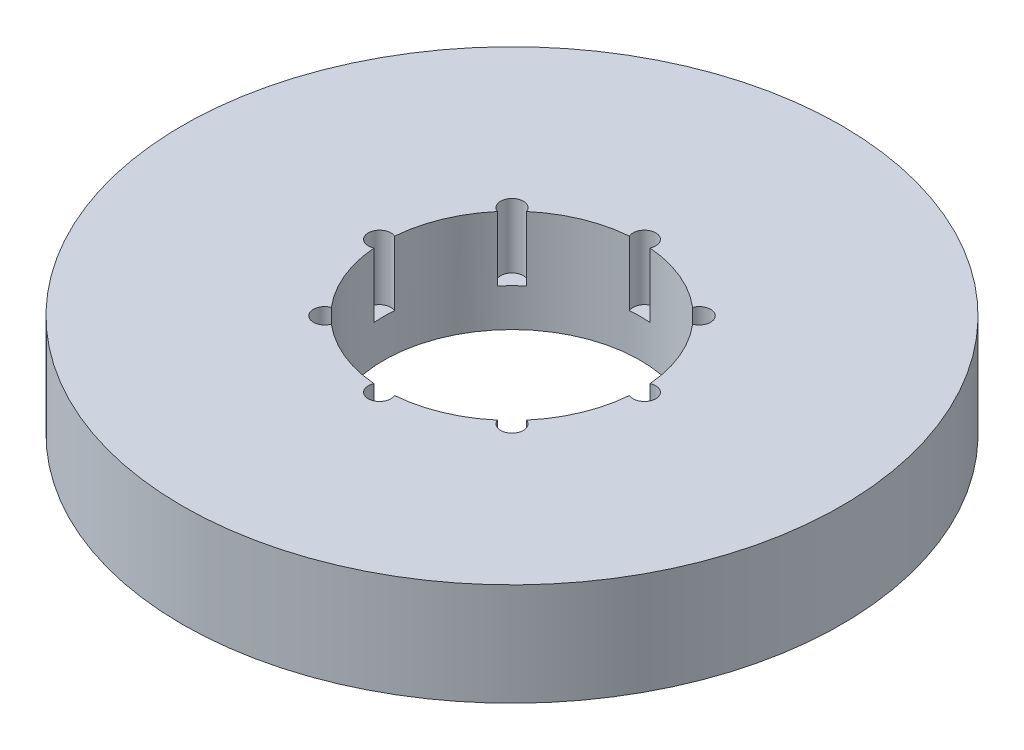
ISO-10303-21;
HEADER;
FILE_DESCRIPTION(('STEP AP214'),'2;1');
FILE_NAME('part.step','',(''),(''),'','','');
FILE_SCHEMA(('AUTOMOTIVE_DESIGN { 1 0 10303 214 1 1 1 1 }'));
ENDSEC;
DATA;
#1=APPLICATION_CONTEXT('core data for automotive mechanical design processes');
#2=APPLICATION_PROTOCOL_DEFINITION('international standard','automotive_design',2000,#1);
#3=PRODUCT_CONTEXT('',#1,'mechanical');
#4=PRODUCT('Part','Part','',(#3));
#5=PRODUCT_RELATED_PRODUCT_CATEGORY('part','',(#4));
#6=PRODUCT_DEFINITION_FORMATION('','',#4);
#7=PRODUCT_DEFINITION_CONTEXT('part definition',#1,'design');
#8=PRODUCT_DEFINITION('design','',#6,#7);
#9=PRODUCT_DEFINITION_SHAPE('','',#8);
#10=(LENGTH_UNIT() NAMED_UNIT(*) SI_UNIT(.MILLI.,.METRE.));
#11=(NAMED_UNIT(*) PLANE_ANGLE_UNIT() SI_UNIT($,.RADIAN.));
#12=(NAMED_UNIT(*) SI_UNIT($,.STERADIAN.) SOLID_ANGLE_UNIT());
#13=UNCERTAINTY_MEASURE_WITH_UNIT(LENGTH_MEASURE(1.E-05),#10,'distance_accuracy_value','');
#14=(GEOMETRIC_REPRESENTATION_CONTEXT(3) GLOBAL_UNCERTAINTY_ASSIGNED_CONTEXT((#13)) GLOBAL_UNIT_ASSIGNED_CONTEXT((#10,
#11,#12)) REPRESENTATION_CONTEXT('',''));
#15=CARTESIAN_POINT('',(0.,0.,0.));
#16=DIRECTION('',(0.,0.,1.));
#17=DIRECTION('',(1.,0.,0.));
#18=AXIS2_PLACEMENT_3D('',#15,#16,#17);
#19=CARTESIAN_POINT('',(0.,28.,0.));
#20=DIRECTION('',(0.,-1.,0.));
#21=DIRECTION('',(0.,0.,-1.));
#22=AXIS2_PLACEMENT_3D('',#19,#20,#21);
#23=CYLINDRICAL_SURFACE('',#22,90.);
#24=CARTESIAN_POINT('',(0.,28.,0.));
#25=DIRECTION('',(0.,1.,0.));
#26=DIRECTION('',(0.,0.,1.));
#27=AXIS2_PLACEMENT_3D('',#24,#25,#26);
#28=CIRCLE('',#27,90.);
#29=CARTESIAN_POINT('',(0.,28.,90.));
#30=VERTEX_POINT('',#29);
#31=EDGE_CURVE('E195',#30,#30,#28,.T.);
#32=ORIENTED_EDGE('',*,*,#31,.F.);
#33=EDGE_LOOP('',(#32));
#34=FACE_BOUND('',#33,.T.);
#35=CARTESIAN_POINT('',(0.,0.,0.));
#36=DIRECTION('',(0.,1.,0.));
#37=DIRECTION('',(0.,0.,1.));
#38=AXIS2_PLACEMENT_3D('',#35,#36,#37);
#39=CIRCLE('',#38,90.);
#40=CARTESIAN_POINT('',(0.,0.,90.));
#41=VERTEX_POINT('',#40);
#42=EDGE_CURVE('E179',#41,#41,#39,.T.);
#43=ORIENTED_EDGE('',*,*,#42,.T.);
#44=EDGE_LOOP('',(#43));
#45=FACE_BOUND('',#44,.T.);
#46=ADVANCED_FACE('F39',(#34,#45),#23,.T.);
#47=CARTESIAN_POINT('',(0.,28.,0.));
#48=DIRECTION('',(0.,1.,0.));
#49=DIRECTION('',(0.,0.,1.));
#50=AXIS2_PLACEMENT_3D('',#47,#48,#49);
#51=PLANE('',#50);
#52=CARTESIAN_POINT('',(1.26258447662943E-13,28.,36.1618566475791));
#53=DIRECTION('',(0.,1.,0.));
#54=DIRECTION('',(1.,0.,0.));
#55=AXIS2_PLACEMENT_3D('',#52,#53,#54);
#56=CIRCLE('',#55,3.08931774554945);
#57=CARTESIAN_POINT('',(-2.81387106271487,28.,34.8867041957594));
#58=VERTEX_POINT('',#57);
#59=CARTESIAN_POINT('',(2.81387106271512,28.,34.8867041957594));
#60=VERTEX_POINT('',#59);
#61=EDGE_CURVE('E176',#58,#60,#56,.T.);
#62=ORIENTED_EDGE('',*,*,#61,.F.);
#63=CARTESIAN_POINT('',(0.,28.,0.));
#64=DIRECTION('',(0.,1.,0.));
#65=DIRECTION('',(0.,0.,1.));
#66=AXIS2_PLACEMENT_3D('',#63,#64,#65);
#67=CIRCLE('',#66,35.);
#68=CARTESIAN_POINT('',(-22.6789178002402,28.,26.6583324199011));
#69=VERTEX_POINT('',#68);
#70=EDGE_CURVE('E166',#69,#58,#67,.T.);
#71=ORIENTED_EDGE('',*,*,#70,.F.);
#72=CARTESIAN_POINT('',(-25.570294055799,28.,25.5702940557991));
#73=DIRECTION('',(0.,1.,0.));
#74=DIRECTION('',(0.707106781186549,0.,0.707106781186546));
#75=AXIS2_PLACEMENT_3D('',#72,#73,#74);
#76=CIRCLE('',#75,3.08931774554945);
#77=CARTESIAN_POINT('',(-26.658332419901,28.,22.6789178002403));
#78=VERTEX_POINT('',#77);
#79=EDGE_CURVE('E147',#78,#69,#76,.T.);
#80=ORIENTED_EDGE('',*,*,#79,.F.);
#81=CARTESIAN_POINT('',(-34.8867041957594,28.,2.81387106271499));
#82=VERTEX_POINT('',#81);
#83=EDGE_CURVE('E180',#82,#78,#67,.T.);
#84=ORIENTED_EDGE('',*,*,#83,.F.);
#85=CARTESIAN_POINT('',(-36.1618566475791,28.,0.));
#86=DIRECTION('',(0.,1.,0.));
#87=DIRECTION('',(0.,0.,1.));
#88=AXIS2_PLACEMENT_3D('',#85,#86,#87);
#89=CIRCLE('',#88,3.08931774554945);
#90=CARTESIAN_POINT('',(-34.8867041957594,28.,-2.81387106271499));
#91=VERTEX_POINT('',#90);
#92=EDGE_CURVE('E186',#91,#82,#89,.T.);
#93=ORIENTED_EDGE('',*,*,#92,.F.);
#94=CARTESIAN_POINT('',(-26.6583324199013,28.,-22.67891780024));
#95=VERTEX_POINT('',#94);
#96=EDGE_CURVE('E182',#95,#91,#67,.T.);
#97=ORIENTED_EDGE('',*,*,#96,.F.);
#98=CARTESIAN_POINT('',(-25.5702940557993,28.,-25.5702940557987));
#99=DIRECTION('',(0.,1.,0.));
#100=DIRECTION('',(-0.707106781186539,0.,0.707106781186556));
#101=AXIS2_PLACEMENT_3D('',#98,#99,#100);
#102=CIRCLE('',#101,3.08931774554945);
#103=CARTESIAN_POINT('',(-22.6789178002406,28.,-26.6583324199007));
#104=VERTEX_POINT('',#103);
#105=EDGE_CURVE('E446',#104,#95,#102,.T.);
#106=ORIENTED_EDGE('',*,*,#105,.F.);
#107=CARTESIAN_POINT('',(-2.81387106271536,28.,-34.8867041957594));
#108=VERTEX_POINT('',#107);
#109=EDGE_CURVE('E452',#108,#104,#67,.T.);
#110=ORIENTED_EDGE('',*,*,#109,.F.);
#111=CARTESIAN_POINT('',(-3.78775342988829E-13,28.,-36.1618566475791));
#112=DIRECTION('',(0.,1.,0.));
#113=DIRECTION('',(-1.,0.,0.));
#114=AXIS2_PLACEMENT_3D('',#111,#112,#113);
#115=CIRCLE('',#114,3.08931774554945);
#116=CARTESIAN_POINT('',(2.81387106271463,28.,-34.8867041957594));
#117=VERTEX_POINT('',#116);
#118=EDGE_CURVE('E477',#117,#108,#115,.T.);
#119=ORIENTED_EDGE('',*,*,#118,.F.);
#120=CARTESIAN_POINT('',(22.67891780024,28.,-26.6583324199012));
#121=VERTEX_POINT('',#120);
#122=EDGE_CURVE('E460',#121,#117,#67,.T.);
#123=ORIENTED_EDGE('',*,*,#122,.F.);
#124=CARTESIAN_POINT('',(25.5702940557988,28.,-25.5702940557993));
#125=DIRECTION('',(0.,1.,0.));
#126=DIRECTION('',(-0.707106781186554,0.,-0.707106781186541));
#127=AXIS2_PLACEMENT_3D('',#124,#125,#126);
#128=CIRCLE('',#127,3.08931774554945);
#129=CARTESIAN_POINT('',(26.6583324199008,28.,-22.6789178002405));
#130=VERTEX_POINT('',#129);
#131=EDGE_CURVE('E464',#130,#121,#128,.T.);
#132=ORIENTED_EDGE('',*,*,#131,.F.);
#133=CARTESIAN_POINT('',(34.8867041957594,28.,-2.81387106271499));
#134=VERTEX_POINT('',#133);
#135=EDGE_CURVE('E459',#134,#130,#67,.T.);
#136=ORIENTED_EDGE('',*,*,#135,.F.);
#137=CARTESIAN_POINT('',(36.1618566475791,28.,0.));
#138=DIRECTION('',(0.,1.,0.));
#139=DIRECTION('',(0.,0.,-1.));
#140=AXIS2_PLACEMENT_3D('',#137,#138,#139);
#141=CIRCLE('',#140,3.08931774554945);
#142=CARTESIAN_POINT('',(34.8867041957594,28.,2.81387106271499));
#143=VERTEX_POINT('',#142);
#144=EDGE_CURVE('E469',#143,#134,#141,.T.);
#145=ORIENTED_EDGE('',*,*,#144,.F.);
#146=CARTESIAN_POINT('',(26.6583324199011,28.,22.6789178002401));
#147=VERTEX_POINT('',#146);
#148=EDGE_CURVE('E181',#147,#143,#67,.T.);
#149=ORIENTED_EDGE('',*,*,#148,.F.);
#150=CARTESIAN_POINT('',(25.5702940557992,28.,25.5702940557989));
#151=DIRECTION('',(0.,1.,0.));
#152=DIRECTION('',(0.707106781186544,0.,-0.707106781186551));
#153=AXIS2_PLACEMENT_3D('',#150,#151,#152);
#154=CIRCLE('',#153,3.08931774554945);
#155=CARTESIAN_POINT('',(22.6789178002404,28.,26.6583324199009));
#156=VERTEX_POINT('',#155);
#157=EDGE_CURVE('E475',#156,#147,#154,.T.);
#158=ORIENTED_EDGE('',*,*,#157,.F.);
#159=EDGE_CURVE('E177',#60,#156,#67,.T.);
#160=ORIENTED_EDGE('',*,*,#159,.F.);
#161=EDGE_LOOP('',(#62,#71,#80,#84,#93,#97,#106,#110,#119,#123,#132,#136,#145,#149,#158,#160));
#162=FACE_BOUND('',#161,.T.);
#163=ORIENTED_EDGE('',*,*,#31,.T.);
#164=EDGE_LOOP('',(#163));
#165=FACE_BOUND('',#164,.T.);
#166=ADVANCED_FACE('F172',(#162,#165),#51,.T.);
#167=CARTESIAN_POINT('',(0.,0.,0.));
#168=DIRECTION('',(0.,1.,0.));
#169=DIRECTION('',(0.,0.,1.));
#170=AXIS2_PLACEMENT_3D('',#167,#168,#169);
#171=PLANE('',#170);
#172=CARTESIAN_POINT('',(0.,0.,0.));
#173=DIRECTION('',(0.,1.,0.));
#174=DIRECTION('',(0.,0.,1.));
#175=AXIS2_PLACEMENT_3D('',#172,#173,#174);
#176=CIRCLE('',#175,35.);
#177=CARTESIAN_POINT('',(0.,0.,35.));
#178=VERTEX_POINT('',#177);
#179=EDGE_CURVE('E187',#178,#178,#176,.T.);
#180=ORIENTED_EDGE('',*,*,#179,.T.);
#181=EDGE_LOOP('',(#180));
#182=FACE_BOUND('',#181,.T.);
#183=ORIENTED_EDGE('',*,*,#42,.F.);
#184=EDGE_LOOP('',(#183));
#185=FACE_BOUND('',#184,.T.);
#186=ADVANCED_FACE('F270',(#182,#185),#171,.F.);
#187=CARTESIAN_POINT('',(0.,28.,0.));
#188=DIRECTION('',(0.,-1.,0.));
#189=DIRECTION('',(0.,0.,-1.));
#190=AXIS2_PLACEMENT_3D('',#187,#188,#189);
#191=CYLINDRICAL_SURFACE('',#190,35.);
#192=DIRECTION('',(0.,1.,0.));
#193=VECTOR('',#192,1.);
#194=CARTESIAN_POINT('',(-2.81387106271487,19.1876380299516,34.8867041957594));
#195=LINE('',#194,#193);
#196=CARTESIAN_POINT('',(-2.81387106271487,10.3752760599031,34.8867041957594));
#197=VERTEX_POINT('',#196);
#198=EDGE_CURVE('E11',#197,#58,#195,.T.);
#199=ORIENTED_EDGE('',*,*,#198,.F.);
#200=CARTESIAN_POINT('',(0.,10.3752760599031,0.));
#201=DIRECTION('',(0.,1.,0.));
#202=DIRECTION('',(0.,0.,1.));
#203=AXIS2_PLACEMENT_3D('',#200,#201,#202);
#204=CIRCLE('',#203,35.);
#205=CARTESIAN_POINT('',(2.81387106271512,10.3752760599031,34.8867041957594));
#206=VERTEX_POINT('',#205);
#207=EDGE_CURVE('E250',#197,#206,#204,.T.);
#208=ORIENTED_EDGE('',*,*,#207,.T.);
#209=DIRECTION('',(0.,1.,0.));
#210=VECTOR('',#209,1.);
#211=CARTESIAN_POINT('',(2.81387106271511,19.1876380299516,34.8867041957594));
#212=LINE('',#211,#210);
#213=EDGE_CURVE('E46',#60,#206,#212,.F.);
#214=ORIENTED_EDGE('',*,*,#213,.F.);
#215=ORIENTED_EDGE('',*,*,#159,.T.);
#216=DIRECTION('',(0.,1.,0.));
#217=VECTOR('',#216,1.);
#218=CARTESIAN_POINT('',(22.6789178002404,19.1876380299516,26.6583324199009));
#219=LINE('',#218,#217);
#220=CARTESIAN_POINT('',(22.6789178002404,10.3752760599031,26.6583324199009));
#221=VERTEX_POINT('',#220);
#222=EDGE_CURVE('E244',#221,#156,#219,.T.);
#223=ORIENTED_EDGE('',*,*,#222,.F.);
#224=CARTESIAN_POINT('',(0.,10.3752760599031,0.));
#225=DIRECTION('',(0.,1.,0.));
#226=DIRECTION('',(0.,0.,1.));
#227=AXIS2_PLACEMENT_3D('',#224,#225,#226);
#228=CIRCLE('',#227,35.);
#229=CARTESIAN_POINT('',(26.6583324199011,10.3752760599031,22.6789178002401));
#230=VERTEX_POINT('',#229);
#231=EDGE_CURVE('E238',#221,#230,#228,.T.);
#232=ORIENTED_EDGE('',*,*,#231,.T.);
#233=DIRECTION('',(0.,1.,0.));
#234=VECTOR('',#233,1.);
#235=CARTESIAN_POINT('',(26.6583324199011,19.1876380299516,22.6789178002401));
#236=LINE('',#235,#234);
#237=EDGE_CURVE('E242',#147,#230,#236,.F.);
#238=ORIENTED_EDGE('',*,*,#237,.F.);
#239=ORIENTED_EDGE('',*,*,#148,.T.);
#240=DIRECTION('',(0.,1.,0.));
#241=VECTOR('',#240,1.);
#242=CARTESIAN_POINT('',(34.8867041957594,19.1876380299516,2.81387106271499));
#243=LINE('',#242,#241);
#244=CARTESIAN_POINT('',(34.8867041957594,10.3752760599031,2.81387106271499));
#245=VERTEX_POINT('',#244);
#246=EDGE_CURVE('E236',#245,#143,#243,.T.);
#247=ORIENTED_EDGE('',*,*,#246,.F.);
#248=CARTESIAN_POINT('',(0.,10.3752760599031,0.));
#249=DIRECTION('',(0.,1.,0.));
#250=DIRECTION('',(0.,0.,1.));
#251=AXIS2_PLACEMENT_3D('',#248,#249,#250);
#252=CIRCLE('',#251,35.);
#253=CARTESIAN_POINT('',(34.8867041957594,10.3752760599031,-2.81387106271499));
#254=VERTEX_POINT('',#253);
#255=EDGE_CURVE('E235',#245,#254,#252,.T.);
#256=ORIENTED_EDGE('',*,*,#255,.T.);
#257=DIRECTION('',(0.,1.,0.));
#258=VECTOR('',#257,1.);
#259=CARTESIAN_POINT('',(34.8867041957594,19.1876380299516,-2.81387106271499));
#260=LINE('',#259,#258);
#261=EDGE_CURVE('E234',#134,#254,#260,.F.);
#262=ORIENTED_EDGE('',*,*,#261,.F.);
#263=ORIENTED_EDGE('',*,*,#135,.T.);
#264=DIRECTION('',(0.,1.,0.));
#265=VECTOR('',#264,1.);
#266=CARTESIAN_POINT('',(26.6583324199008,19.1876380299516,-22.6789178002405));
#267=LINE('',#266,#265);
#268=CARTESIAN_POINT('',(26.6583324199008,10.3752760599031,-22.6789178002405));
#269=VERTEX_POINT('',#268);
#270=EDGE_CURVE('E229',#269,#130,#267,.T.);
#271=ORIENTED_EDGE('',*,*,#270,.F.);
#272=CARTESIAN_POINT('',(0.,10.3752760599031,0.));
#273=DIRECTION('',(0.,1.,0.));
#274=DIRECTION('',(0.,0.,1.));
#275=AXIS2_PLACEMENT_3D('',#272,#273,#274);
#276=CIRCLE('',#275,35.);
#277=CARTESIAN_POINT('',(22.67891780024,10.3752760599031,-26.6583324199012));
#278=VERTEX_POINT('',#277);
#279=EDGE_CURVE('E221',#269,#278,#276,.T.);
#280=ORIENTED_EDGE('',*,*,#279,.T.);
#281=DIRECTION('',(0.,1.,0.));
#282=VECTOR('',#281,1.);
#283=CARTESIAN_POINT('',(22.67891780024,19.1876380299516,-26.6583324199012));
#284=LINE('',#283,#282);
#285=EDGE_CURVE('E230',#121,#278,#284,.F.);
#286=ORIENTED_EDGE('',*,*,#285,.F.);
#287=ORIENTED_EDGE('',*,*,#122,.T.);
#288=DIRECTION('',(0.,1.,0.));
#289=VECTOR('',#288,1.);
#290=CARTESIAN_POINT('',(2.81387106271463,19.1876380299516,-34.8867041957594));
#291=LINE('',#290,#289);
#292=CARTESIAN_POINT('',(2.81387106271463,10.3752760599031,-34.8867041957594));
#293=VERTEX_POINT('',#292);
#294=EDGE_CURVE('E225',#293,#117,#291,.T.);
#295=ORIENTED_EDGE('',*,*,#294,.F.);
#296=CARTESIAN_POINT('',(0.,10.3752760599031,0.));
#297=DIRECTION('',(0.,1.,0.));
#298=DIRECTION('',(0.,0.,1.));
#299=AXIS2_PLACEMENT_3D('',#296,#297,#298);
#300=CIRCLE('',#299,35.);
#301=CARTESIAN_POINT('',(-2.81387106271536,10.3752760599031,-34.8867041957594));
#302=VERTEX_POINT('',#301);
#303=EDGE_CURVE('E216',#293,#302,#300,.T.);
#304=ORIENTED_EDGE('',*,*,#303,.T.);
#305=DIRECTION('',(0.,1.,0.));
#306=VECTOR('',#305,1.);
#307=CARTESIAN_POINT('',(-2.81387106271536,19.1876380299516,-34.8867041957594));
#308=LINE('',#307,#306);
#309=EDGE_CURVE('E218',#108,#302,#308,.F.);
#310=ORIENTED_EDGE('',*,*,#309,.F.);
#311=ORIENTED_EDGE('',*,*,#109,.T.);
#312=DIRECTION('',(0.,1.,0.));
#313=VECTOR('',#312,1.);
#314=CARTESIAN_POINT('',(-22.6789178002406,19.1876380299516,-26.6583324199007));
#315=LINE('',#314,#313);
#316=CARTESIAN_POINT('',(-22.6789178002406,10.3752760599031,-26.6583324199007));
#317=VERTEX_POINT('',#316);
#318=EDGE_CURVE('E212',#317,#104,#315,.T.);
#319=ORIENTED_EDGE('',*,*,#318,.F.);
#320=CARTESIAN_POINT('',(0.,10.3752760599031,0.));
#321=DIRECTION('',(0.,1.,0.));
#322=DIRECTION('',(0.,0.,1.));
#323=AXIS2_PLACEMENT_3D('',#320,#321,#322);
#324=CIRCLE('',#323,35.);
#325=CARTESIAN_POINT('',(-26.6583324199013,10.3752760599031,-22.67891780024));
#326=VERTEX_POINT('',#325);
#327=EDGE_CURVE('E208',#317,#326,#324,.T.);
#328=ORIENTED_EDGE('',*,*,#327,.T.);
#329=DIRECTION('',(0.,1.,0.));
#330=VECTOR('',#329,1.);
#331=CARTESIAN_POINT('',(-26.6583324199013,19.1876380299516,-22.67891780024));
#332=LINE('',#331,#330);
#333=EDGE_CURVE('E211',#95,#326,#332,.F.);
#334=ORIENTED_EDGE('',*,*,#333,.F.);
#335=ORIENTED_EDGE('',*,*,#96,.T.);
#336=DIRECTION('',(0.,1.,0.));
#337=VECTOR('',#336,1.);
#338=CARTESIAN_POINT('',(-34.8867041957594,19.1876380299516,-2.81387106271499));
#339=LINE('',#338,#337);
#340=CARTESIAN_POINT('',(-34.8867041957594,10.3752760599031,-2.81387106271499));
#341=VERTEX_POINT('',#340);
#342=EDGE_CURVE('E201',#341,#91,#339,.T.);
#343=ORIENTED_EDGE('',*,*,#342,.F.);
#344=CARTESIAN_POINT('',(0.,10.3752760599031,0.));
#345=DIRECTION('',(0.,1.,0.));
#346=DIRECTION('',(0.,0.,1.));
#347=AXIS2_PLACEMENT_3D('',#344,#345,#346);
#348=CIRCLE('',#347,35.);
#349=CARTESIAN_POINT('',(-34.8867041957594,10.3752760599031,2.81387106271499));
#350=VERTEX_POINT('',#349);
#351=EDGE_CURVE('E194',#341,#350,#348,.T.);
#352=ORIENTED_EDGE('',*,*,#351,.T.);
#353=DIRECTION('',(0.,1.,0.));
#354=VECTOR('',#353,1.);
#355=CARTESIAN_POINT('',(-34.8867041957594,19.1876380299516,2.81387106271499));
#356=LINE('',#355,#354);
#357=EDGE_CURVE('E199',#82,#350,#356,.F.);
#358=ORIENTED_EDGE('',*,*,#357,.F.);
#359=ORIENTED_EDGE('',*,*,#83,.T.);
#360=DIRECTION('',(0.,1.,0.));
#361=VECTOR('',#360,1.);
#362=CARTESIAN_POINT('',(-26.658332419901,19.1876380299516,22.6789178002403));
#363=LINE('',#362,#361);
#364=CARTESIAN_POINT('',(-26.658332419901,10.3752760599031,22.6789178002403));
#365=VERTEX_POINT('',#364);
#366=EDGE_CURVE('E160',#365,#78,#363,.T.);
#367=ORIENTED_EDGE('',*,*,#366,.F.);
#368=CARTESIAN_POINT('',(0.,10.3752760599031,0.));
#369=DIRECTION('',(0.,1.,0.));
#370=DIRECTION('',(0.,0.,1.));
#371=AXIS2_PLACEMENT_3D('',#368,#369,#370);
#372=CIRCLE('',#371,35.);
#373=CARTESIAN_POINT('',(-22.6789178002402,10.3752760599031,26.6583324199011));
#374=VERTEX_POINT('',#373);
#375=EDGE_CURVE('E168',#365,#374,#372,.T.);
#376=ORIENTED_EDGE('',*,*,#375,.T.);
#377=DIRECTION('',(0.,1.,0.));
#378=VECTOR('',#377,1.);
#379=CARTESIAN_POINT('',(-22.6789178002402,19.1876380299516,26.6583324199011));
#380=LINE('',#379,#378);
#381=EDGE_CURVE('E152',#69,#374,#380,.F.);
#382=ORIENTED_EDGE('',*,*,#381,.F.);
#383=ORIENTED_EDGE('',*,*,#70,.T.);
#384=EDGE_LOOP('',(#199,#208,#214,#215,#223,#232,#238,#239,#247,#256,#262,#263,#271,#280,#286,
#287,#295,#304,#310,#311,#319,#328,#334,#335,#343,#352,#358,#359,#367,#376,#382,#383));
#385=FACE_BOUND('',#384,.T.);
#386=ORIENTED_EDGE('',*,*,#179,.F.);
#387=EDGE_LOOP('',(#386));
#388=FACE_BOUND('',#387,.T.);
#389=ADVANCED_FACE('F170',(#385,#388),#191,.F.);
#390=CARTESIAN_POINT('',(-36.1618566475791,10.3752760599031,0.));
#391=DIRECTION('',(0.,1.,0.));
#392=DIRECTION('',(0.,0.,1.));
#393=AXIS2_PLACEMENT_3D('',#390,#391,#392);
#394=CYLINDRICAL_SURFACE('',#393,3.08931774554945);
#395=ORIENTED_EDGE('',*,*,#342,.T.);
#396=ORIENTED_EDGE('',*,*,#92,.T.);
#397=ORIENTED_EDGE('',*,*,#357,.T.);
#398=CARTESIAN_POINT('',(-36.1618566475791,10.3752760599031,0.));
#399=DIRECTION('',(0.,1.,0.));
#400=DIRECTION('',(0.,0.,1.));
#401=AXIS2_PLACEMENT_3D('',#398,#399,#400);
#402=CIRCLE('',#401,3.08931774554945);
#403=EDGE_CURVE('E191',#341,#350,#402,.T.);
#404=ORIENTED_EDGE('',*,*,#403,.F.);
#405=EDGE_LOOP('',(#395,#396,#397,#404));
#406=FACE_BOUND('',#405,.T.);
#407=ADVANCED_FACE('F279',(#406),#394,.F.);
#408=CARTESIAN_POINT('',(-36.1618566475791,10.3752760599031,0.));
#409=DIRECTION('',(0.,1.,0.));
#410=DIRECTION('',(0.,0.,1.));
#411=AXIS2_PLACEMENT_3D('',#408,#409,#410);
#412=PLANE('',#411);
#413=ORIENTED_EDGE('',*,*,#403,.T.);
#414=ORIENTED_EDGE('',*,*,#351,.F.);
#415=EDGE_LOOP('',(#413,#414));
#416=FACE_BOUND('',#415,.T.);
#417=ADVANCED_FACE('F285',(#416),#412,.T.);
#418=CARTESIAN_POINT('',(-25.570294055799,10.3752760599031,25.5702940557991));
#419=DIRECTION('',(0.,1.,0.));
#420=DIRECTION('',(0.,0.,1.));
#421=AXIS2_PLACEMENT_3D('',#418,#419,#420);
#422=CYLINDRICAL_SURFACE('',#421,3.08931774554945);
#423=ORIENTED_EDGE('',*,*,#366,.T.);
#424=ORIENTED_EDGE('',*,*,#79,.T.);
#425=ORIENTED_EDGE('',*,*,#381,.T.);
#426=CARTESIAN_POINT('',(-25.570294055799,10.3752760599031,25.5702940557991));
#427=DIRECTION('',(0.,1.,0.));
#428=DIRECTION('',(0.707106781186549,0.,0.707106781186546));
#429=AXIS2_PLACEMENT_3D('',#426,#427,#428);
#430=CIRCLE('',#429,3.08931774554945);
#431=EDGE_CURVE('E165',#365,#374,#430,.T.);
#432=ORIENTED_EDGE('',*,*,#431,.F.);
#433=EDGE_LOOP('',(#423,#424,#425,#432));
#434=FACE_BOUND('',#433,.T.);
#435=ADVANCED_FACE('F155',(#434),#422,.F.);
#436=CARTESIAN_POINT('',(-25.570294055799,10.3752760599031,25.5702940557991));
#437=DIRECTION('',(0.,1.,0.));
#438=DIRECTION('',(0.707106781186549,0.,0.707106781186546));
#439=AXIS2_PLACEMENT_3D('',#436,#437,#438);
#440=PLANE('',#439);
#441=ORIENTED_EDGE('',*,*,#431,.T.);
#442=ORIENTED_EDGE('',*,*,#375,.F.);
#443=EDGE_LOOP('',(#441,#442));
#444=FACE_BOUND('',#443,.T.);
#445=ADVANCED_FACE('F288',(#444),#440,.T.);
#446=CARTESIAN_POINT('',(-25.5702940557993,10.3752760599031,-25.5702940557987));
#447=DIRECTION('',(0.,1.,0.));
#448=DIRECTION('',(0.,0.,1.));
#449=AXIS2_PLACEMENT_3D('',#446,#447,#448);
#450=CYLINDRICAL_SURFACE('',#449,3.08931774554945);
#451=ORIENTED_EDGE('',*,*,#318,.T.);
#452=ORIENTED_EDGE('',*,*,#105,.T.);
#453=ORIENTED_EDGE('',*,*,#333,.T.);
#454=CARTESIAN_POINT('',(-25.5702940557993,10.3752760599031,-25.5702940557987));
#455=DIRECTION('',(0.,1.,0.));
#456=DIRECTION('',(-0.707106781186539,0.,0.707106781186556));
#457=AXIS2_PLACEMENT_3D('',#454,#455,#456);
#458=CIRCLE('',#457,3.08931774554945);
#459=EDGE_CURVE('E447',#317,#326,#458,.T.);
#460=ORIENTED_EDGE('',*,*,#459,.F.);
#461=EDGE_LOOP('',(#451,#452,#453,#460));
#462=FACE_BOUND('',#461,.T.);
#463=ADVANCED_FACE('F295',(#462),#450,.F.);
#464=CARTESIAN_POINT('',(-25.5702940557993,10.3752760599031,-25.5702940557987));
#465=DIRECTION('',(0.,1.,0.));
#466=DIRECTION('',(-0.707106781186539,0.,0.707106781186556));
#467=AXIS2_PLACEMENT_3D('',#464,#465,#466);
#468=PLANE('',#467);
#469=ORIENTED_EDGE('',*,*,#459,.T.);
#470=ORIENTED_EDGE('',*,*,#327,.F.);
#471=EDGE_LOOP('',(#469,#470));
#472=FACE_BOUND('',#471,.T.);
#473=ADVANCED_FACE('F375',(#472),#468,.T.);
#474=CARTESIAN_POINT('',(-3.78775342988829E-13,10.3752760599031,-36.1618566475791));
#475=DIRECTION('',(0.,1.,0.));
#476=DIRECTION('',(0.,0.,1.));
#477=AXIS2_PLACEMENT_3D('',#474,#475,#476);
#478=CYLINDRICAL_SURFACE('',#477,3.08931774554945);
#479=ORIENTED_EDGE('',*,*,#294,.T.);
#480=ORIENTED_EDGE('',*,*,#118,.T.);
#481=ORIENTED_EDGE('',*,*,#309,.T.);
#482=CARTESIAN_POINT('',(-3.78775342988829E-13,10.3752760599031,-36.1618566475791));
#483=DIRECTION('',(0.,1.,0.));
#484=DIRECTION('',(-1.,0.,0.));
#485=AXIS2_PLACEMENT_3D('',#482,#483,#484);
#486=CIRCLE('',#485,3.08931774554945);
#487=EDGE_CURVE('E467',#293,#302,#486,.T.);
#488=ORIENTED_EDGE('',*,*,#487,.F.);
#489=EDGE_LOOP('',(#479,#480,#481,#488));
#490=FACE_BOUND('',#489,.T.);
#491=ADVANCED_FACE('F361',(#490),#478,.F.);
#492=CARTESIAN_POINT('',(-3.78775342988829E-13,10.3752760599031,-36.1618566475791));
#493=DIRECTION('',(0.,1.,0.));
#494=DIRECTION('',(-1.,0.,0.));
#495=AXIS2_PLACEMENT_3D('',#492,#493,#494);
#496=PLANE('',#495);
#497=ORIENTED_EDGE('',*,*,#487,.T.);
#498=ORIENTED_EDGE('',*,*,#303,.F.);
#499=EDGE_LOOP('',(#497,#498));
#500=FACE_BOUND('',#499,.T.);
#501=ADVANCED_FACE('F297',(#500),#496,.T.);
#502=CARTESIAN_POINT('',(25.5702940557988,10.3752760599031,-25.5702940557993));
#503=DIRECTION('',(0.,1.,0.));
#504=DIRECTION('',(0.,0.,1.));
#505=AXIS2_PLACEMENT_3D('',#502,#503,#504);
#506=CYLINDRICAL_SURFACE('',#505,3.08931774554945);
#507=ORIENTED_EDGE('',*,*,#270,.T.);
#508=ORIENTED_EDGE('',*,*,#131,.T.);
#509=ORIENTED_EDGE('',*,*,#285,.T.);
#510=CARTESIAN_POINT('',(25.5702940557988,10.3752760599031,-25.5702940557993));
#511=DIRECTION('',(0.,1.,0.));
#512=DIRECTION('',(-0.707106781186554,0.,-0.707106781186541));
#513=AXIS2_PLACEMENT_3D('',#510,#511,#512);
#514=CIRCLE('',#513,3.08931774554945);
#515=EDGE_CURVE('E470',#269,#278,#514,.T.);
#516=ORIENTED_EDGE('',*,*,#515,.F.);
#517=EDGE_LOOP('',(#507,#508,#509,#516));
#518=FACE_BOUND('',#517,.T.);
#519=ADVANCED_FACE('F294',(#518),#506,.F.);
#520=CARTESIAN_POINT('',(25.5702940557988,10.3752760599031,-25.5702940557993));
#521=DIRECTION('',(0.,1.,0.));
#522=DIRECTION('',(-0.707106781186554,0.,-0.707106781186541));
#523=AXIS2_PLACEMENT_3D('',#520,#521,#522);
#524=PLANE('',#523);
#525=ORIENTED_EDGE('',*,*,#515,.T.);
#526=ORIENTED_EDGE('',*,*,#279,.F.);
#527=EDGE_LOOP('',(#525,#526));
#528=FACE_BOUND('',#527,.T.);
#529=ADVANCED_FACE('F300',(#528),#524,.T.);
#530=CARTESIAN_POINT('',(36.1618566475791,10.3752760599031,0.));
#531=DIRECTION('',(0.,1.,0.));
#532=DIRECTION('',(0.,0.,1.));
#533=AXIS2_PLACEMENT_3D('',#530,#531,#532);
#534=CYLINDRICAL_SURFACE('',#533,3.08931774554945);
#535=ORIENTED_EDGE('',*,*,#246,.T.);
#536=ORIENTED_EDGE('',*,*,#144,.T.);
#537=ORIENTED_EDGE('',*,*,#261,.T.);
#538=CARTESIAN_POINT('',(36.1618566475791,10.3752760599031,0.));
#539=DIRECTION('',(0.,1.,0.));
#540=DIRECTION('',(0.,0.,-1.));
#541=AXIS2_PLACEMENT_3D('',#538,#539,#540);
#542=CIRCLE('',#541,3.08931774554945);
#543=EDGE_CURVE('E472',#245,#254,#542,.T.);
#544=ORIENTED_EDGE('',*,*,#543,.F.);
#545=EDGE_LOOP('',(#535,#536,#537,#544));
#546=FACE_BOUND('',#545,.T.);
#547=ADVANCED_FACE('F305',(#546),#534,.F.);
#548=CARTESIAN_POINT('',(36.1618566475791,10.3752760599031,0.));
#549=DIRECTION('',(0.,1.,0.));
#550=DIRECTION('',(0.,0.,-1.));
#551=AXIS2_PLACEMENT_3D('',#548,#549,#550);
#552=PLANE('',#551);
#553=ORIENTED_EDGE('',*,*,#543,.T.);
#554=ORIENTED_EDGE('',*,*,#255,.F.);
#555=EDGE_LOOP('',(#553,#554));
#556=FACE_BOUND('',#555,.T.);
#557=ADVANCED_FACE('F308',(#556),#552,.T.);
#558=CARTESIAN_POINT('',(25.5702940557992,10.3752760599031,25.5702940557989));
#559=DIRECTION('',(0.,1.,0.));
#560=DIRECTION('',(0.,0.,1.));
#561=AXIS2_PLACEMENT_3D('',#558,#559,#560);
#562=CYLINDRICAL_SURFACE('',#561,3.08931774554945);
#563=ORIENTED_EDGE('',*,*,#222,.T.);
#564=ORIENTED_EDGE('',*,*,#157,.T.);
#565=ORIENTED_EDGE('',*,*,#237,.T.);
#566=CARTESIAN_POINT('',(25.5702940557992,10.3752760599031,25.5702940557989));
#567=DIRECTION('',(0.,1.,0.));
#568=DIRECTION('',(0.707106781186544,0.,-0.707106781186551));
#569=AXIS2_PLACEMENT_3D('',#566,#567,#568);
#570=CIRCLE('',#569,3.08931774554945);
#571=EDGE_CURVE('E56',#221,#230,#570,.T.);
#572=ORIENTED_EDGE('',*,*,#571,.F.);
#573=EDGE_LOOP('',(#563,#564,#565,#572));
#574=FACE_BOUND('',#573,.T.);
#575=ADVANCED_FACE('F309',(#574),#562,.F.);
#576=CARTESIAN_POINT('',(25.5702940557992,10.3752760599031,25.5702940557989));
#577=DIRECTION('',(0.,1.,0.));
#578=DIRECTION('',(0.707106781186544,0.,-0.707106781186551));
#579=AXIS2_PLACEMENT_3D('',#576,#577,#578);
#580=PLANE('',#579);
#581=ORIENTED_EDGE('',*,*,#571,.T.);
#582=ORIENTED_EDGE('',*,*,#231,.F.);
#583=EDGE_LOOP('',(#581,#582));
#584=FACE_BOUND('',#583,.T.);
#585=ADVANCED_FACE('F256',(#584),#580,.T.);
#586=CARTESIAN_POINT('',(1.26258447662943E-13,10.3752760599031,36.1618566475791));
#587=DIRECTION('',(0.,1.,0.));
#588=DIRECTION('',(0.,0.,1.));
#589=AXIS2_PLACEMENT_3D('',#586,#587,#588);
#590=CYLINDRICAL_SURFACE('',#589,3.08931774554945);
#591=ORIENTED_EDGE('',*,*,#198,.T.);
#592=ORIENTED_EDGE('',*,*,#61,.T.);
#593=ORIENTED_EDGE('',*,*,#213,.T.);
#594=CARTESIAN_POINT('',(1.26258447662943E-13,10.3752760599031,36.1618566475791));
#595=DIRECTION('',(0.,1.,0.));
#596=DIRECTION('',(1.,0.,0.));
#597=AXIS2_PLACEMENT_3D('',#594,#595,#596);
#598=CIRCLE('',#597,3.08931774554945);
#599=EDGE_CURVE('E55',#197,#206,#598,.T.);
#600=ORIENTED_EDGE('',*,*,#599,.F.);
#601=EDGE_LOOP('',(#591,#592,#593,#600));
#602=FACE_BOUND('',#601,.T.);
#603=ADVANCED_FACE('F253',(#602),#590,.F.);
#604=CARTESIAN_POINT('',(1.26258447662943E-13,10.3752760599031,36.1618566475791));
#605=DIRECTION('',(0.,1.,0.));
#606=DIRECTION('',(1.,0.,0.));
#607=AXIS2_PLACEMENT_3D('',#604,#605,#606);
#608=PLANE('',#607);
#609=ORIENTED_EDGE('',*,*,#599,.T.);
#610=ORIENTED_EDGE('',*,*,#207,.F.);
#611=EDGE_LOOP('',(#609,#610));
#612=FACE_BOUND('',#611,.T.);
#613=ADVANCED_FACE('F252',(#612),#608,.T.);
#614=CLOSED_SHELL('',(#46,#166,#186,#389,#407,#417,#435,#445,#463,#473,#491,#501,#519,#529,#547,
#557,#575,#585,#603,#613));
#615=MANIFOLD_SOLID_BREP('B2',#614);
#616=ADVANCED_BREP_SHAPE_REPRESENTATION('',(#18,#615),#14);
#617=SHAPE_DEFINITION_REPRESENTATION(#9,#616);
ENDSEC;
END-ISO-10303-21;
